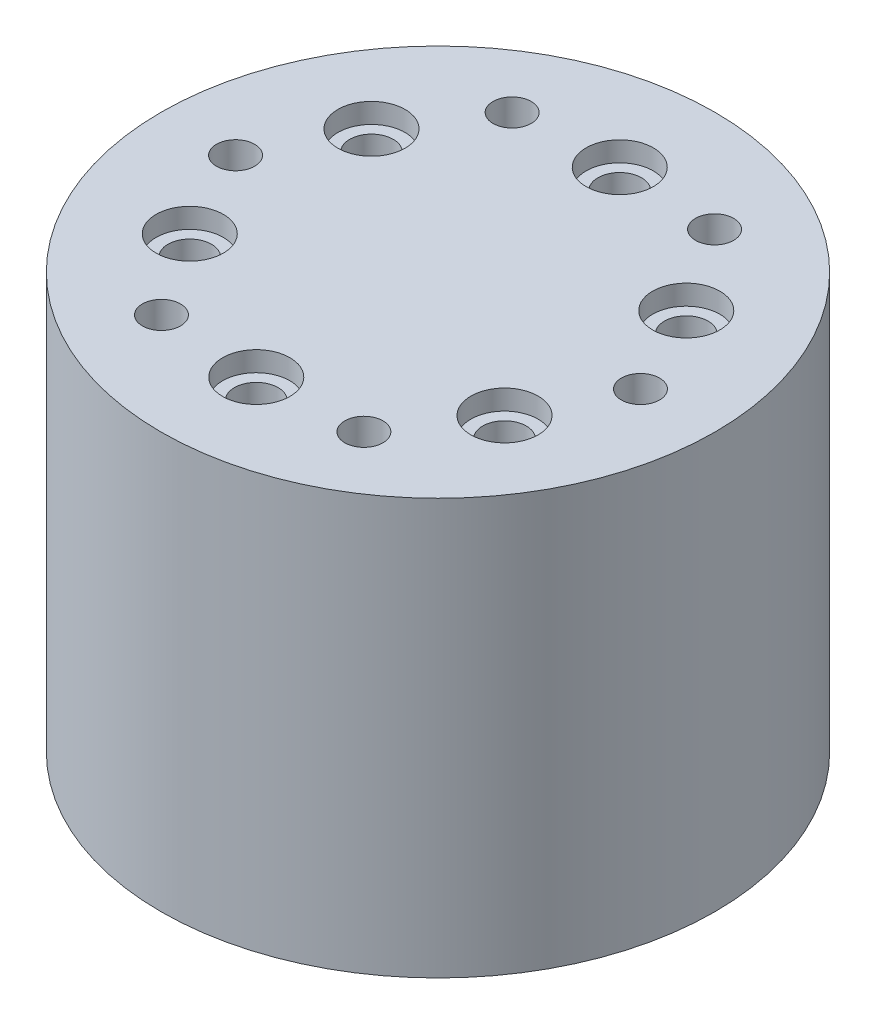
ISO-10303-21;
HEADER;
FILE_DESCRIPTION(('STEP AP214'),'2;1');
FILE_NAME('part.step','',(''),(''),'','','');
FILE_SCHEMA(('AUTOMOTIVE_DESIGN { 1 0 10303 214 1 1 1 1 }'));
ENDSEC;
DATA;
#1=APPLICATION_CONTEXT('core data for automotive mechanical design processes');
#2=APPLICATION_PROTOCOL_DEFINITION('international standard','automotive_design',2000,#1);
#3=PRODUCT_CONTEXT('',#1,'mechanical');
#4=PRODUCT('Part','Part','',(#3));
#5=PRODUCT_RELATED_PRODUCT_CATEGORY('part','',(#4));
#6=PRODUCT_DEFINITION_FORMATION('','',#4);
#7=PRODUCT_DEFINITION_CONTEXT('part definition',#1,'design');
#8=PRODUCT_DEFINITION('design','',#6,#7);
#9=PRODUCT_DEFINITION_SHAPE('','',#8);
#10=(LENGTH_UNIT() NAMED_UNIT(*) SI_UNIT(.MILLI.,.METRE.));
#11=(NAMED_UNIT(*) PLANE_ANGLE_UNIT() SI_UNIT($,.RADIAN.));
#12=(NAMED_UNIT(*) SI_UNIT($,.STERADIAN.) SOLID_ANGLE_UNIT());
#13=UNCERTAINTY_MEASURE_WITH_UNIT(LENGTH_MEASURE(1.E-05),#10,'distance_accuracy_value','');
#14=(GEOMETRIC_REPRESENTATION_CONTEXT(3) GLOBAL_UNCERTAINTY_ASSIGNED_CONTEXT((#13)) GLOBAL_UNIT_ASSIGNED_CONTEXT((#10,
#11,#12)) REPRESENTATION_CONTEXT('',''));
#15=CARTESIAN_POINT('',(0.,0.,0.));
#16=DIRECTION('',(0.,0.,1.));
#17=DIRECTION('',(1.,0.,0.));
#18=AXIS2_PLACEMENT_3D('',#15,#16,#17);
#19=CARTESIAN_POINT('',(0.,114.3,0.));
#20=DIRECTION('',(0.,-1.,0.));
#21=DIRECTION('',(0.,0.,-1.));
#22=AXIS2_PLACEMENT_3D('',#19,#20,#21);
#23=CYLINDRICAL_SURFACE('',#22,76.2);
#24=CARTESIAN_POINT('',(0.,114.3,0.));
#25=DIRECTION('',(0.,1.,0.));
#26=DIRECTION('',(0.,0.,1.));
#27=AXIS2_PLACEMENT_3D('',#24,#25,#26);
#28=CIRCLE('',#27,76.2);
#29=CARTESIAN_POINT('',(0.,114.3,76.2));
#30=VERTEX_POINT('',#29);
#31=EDGE_CURVE('E11',#30,#30,#28,.T.);
#32=ORIENTED_EDGE('',*,*,#31,.F.);
#33=EDGE_LOOP('',(#32));
#34=FACE_BOUND('',#33,.T.);
#35=CARTESIAN_POINT('',(0.,0.,0.));
#36=DIRECTION('',(0.,1.,0.));
#37=DIRECTION('',(0.,0.,1.));
#38=AXIS2_PLACEMENT_3D('',#35,#36,#37);
#39=CIRCLE('',#38,76.2);
#40=CARTESIAN_POINT('',(0.,0.,76.2));
#41=VERTEX_POINT('',#40);
#42=EDGE_CURVE('E46',#41,#41,#39,.T.);
#43=ORIENTED_EDGE('',*,*,#42,.T.);
#44=EDGE_LOOP('',(#43));
#45=FACE_BOUND('',#44,.T.);
#46=ADVANCED_FACE('F43',(#34,#45),#23,.T.);
#47=CARTESIAN_POINT('',(0.,114.3,0.));
#48=DIRECTION('',(0.,1.,0.));
#49=DIRECTION('',(0.,0.,1.));
#50=AXIS2_PLACEMENT_3D('',#47,#48,#49);
#51=PLANE('',#50);
#52=CARTESIAN_POINT('',(27.8500000000006,114.3,-48.2376149907929));
#53=DIRECTION('',(0.,1.,0.));
#54=DIRECTION('',(0.,0.,1.));
#55=AXIS2_PLACEMENT_3D('',#52,#53,#54);
#56=CIRCLE('',#55,5.24999999999999);
#57=CARTESIAN_POINT('',(27.8500000000006,114.3,-42.9876149907929));
#58=VERTEX_POINT('',#57);
#59=EDGE_CURVE('E80',#58,#58,#56,.T.);
#60=ORIENTED_EDGE('',*,*,#59,.F.);
#61=EDGE_LOOP('',(#60));
#62=FACE_BOUND('',#61,.T.);
#63=CARTESIAN_POINT('',(-27.8499999999996,114.3,-48.2376149907935));
#64=DIRECTION('',(0.,1.,0.));
#65=DIRECTION('',(0.,0.,1.));
#66=AXIS2_PLACEMENT_3D('',#63,#64,#65);
#67=CIRCLE('',#66,5.24999999999999);
#68=CARTESIAN_POINT('',(-27.8499999999996,114.3,-42.9876149907935));
#69=VERTEX_POINT('',#68);
#70=EDGE_CURVE('E79',#69,#69,#67,.T.);
#71=ORIENTED_EDGE('',*,*,#70,.F.);
#72=EDGE_LOOP('',(#71));
#73=FACE_BOUND('',#72,.T.);
#74=CARTESIAN_POINT('',(-55.7,114.3,0.));
#75=DIRECTION('',(0.,1.,0.));
#76=DIRECTION('',(0.,0.,1.));
#77=AXIS2_PLACEMENT_3D('',#74,#75,#76);
#78=CIRCLE('',#77,5.24999999999999);
#79=CARTESIAN_POINT('',(-55.7,114.3,5.24999999999999));
#80=VERTEX_POINT('',#79);
#81=EDGE_CURVE('E90',#80,#80,#78,.T.);
#82=ORIENTED_EDGE('',*,*,#81,.F.);
#83=EDGE_LOOP('',(#82));
#84=FACE_BOUND('',#83,.T.);
#85=CARTESIAN_POINT('',(-27.8500000000002,114.3,48.2376149907931));
#86=DIRECTION('',(0.,1.,0.));
#87=DIRECTION('',(0.,0.,1.));
#88=AXIS2_PLACEMENT_3D('',#85,#86,#87);
#89=CIRCLE('',#88,5.24999999999999);
#90=CARTESIAN_POINT('',(-27.8500000000002,114.3,53.4876149907931));
#91=VERTEX_POINT('',#90);
#92=EDGE_CURVE('E96',#91,#91,#89,.T.);
#93=ORIENTED_EDGE('',*,*,#92,.F.);
#94=EDGE_LOOP('',(#93));
#95=FACE_BOUND('',#94,.T.);
#96=CARTESIAN_POINT('',(27.8499999999999,114.3,48.2376149907933));
#97=DIRECTION('',(0.,1.,0.));
#98=DIRECTION('',(0.,0.,1.));
#99=AXIS2_PLACEMENT_3D('',#96,#97,#98);
#100=CIRCLE('',#99,5.24999999999999);
#101=CARTESIAN_POINT('',(27.8499999999999,114.3,53.4876149907933));
#102=VERTEX_POINT('',#101);
#103=EDGE_CURVE('E102',#102,#102,#100,.T.);
#104=ORIENTED_EDGE('',*,*,#103,.F.);
#105=EDGE_LOOP('',(#104));
#106=FACE_BOUND('',#105,.T.);
#107=CARTESIAN_POINT('',(55.7,114.3,0.));
#108=DIRECTION('',(0.,1.,0.));
#109=DIRECTION('',(0.,0.,1.));
#110=AXIS2_PLACEMENT_3D('',#107,#108,#109);
#111=CIRCLE('',#110,5.24999999999999);
#112=CARTESIAN_POINT('',(55.7,114.3,5.24999999999999));
#113=VERTEX_POINT('',#112);
#114=EDGE_CURVE('E108',#113,#113,#111,.T.);
#115=ORIENTED_EDGE('',*,*,#114,.F.);
#116=EDGE_LOOP('',(#115));
#117=FACE_BOUND('',#116,.T.);
#118=CARTESIAN_POINT('',(0.,114.3,-50.));
#119=DIRECTION('',(0.,1.,0.));
#120=DIRECTION('',(0.,0.,1.));
#121=AXIS2_PLACEMENT_3D('',#118,#119,#120);
#122=CIRCLE('',#121,9.25);
#123=CARTESIAN_POINT('',(0.,114.3,-40.75));
#124=VERTEX_POINT('',#123);
#125=EDGE_CURVE('E114',#124,#124,#122,.T.);
#126=ORIENTED_EDGE('',*,*,#125,.F.);
#127=EDGE_LOOP('',(#126));
#128=FACE_BOUND('',#127,.T.);
#129=CARTESIAN_POINT('',(43.3012701892219,114.3,-25.));
#130=DIRECTION('',(0.,1.,0.));
#131=DIRECTION('',(0.,0.,1.));
#132=AXIS2_PLACEMENT_3D('',#129,#130,#131);
#133=CIRCLE('',#132,9.24999999999999);
#134=CARTESIAN_POINT('',(43.3012701892219,114.3,-15.75));
#135=VERTEX_POINT('',#134);
#136=EDGE_CURVE('E126',#135,#135,#133,.T.);
#137=ORIENTED_EDGE('',*,*,#136,.F.);
#138=EDGE_LOOP('',(#137));
#139=FACE_BOUND('',#138,.T.);
#140=CARTESIAN_POINT('',(43.3012701892219,114.3,25.));
#141=DIRECTION('',(0.,1.,0.));
#142=DIRECTION('',(0.,0.,1.));
#143=AXIS2_PLACEMENT_3D('',#140,#141,#142);
#144=CIRCLE('',#143,9.24999999999999);
#145=CARTESIAN_POINT('',(43.3012701892219,114.3,34.25));
#146=VERTEX_POINT('',#145);
#147=EDGE_CURVE('E138',#146,#146,#144,.T.);
#148=ORIENTED_EDGE('',*,*,#147,.F.);
#149=EDGE_LOOP('',(#148));
#150=FACE_BOUND('',#149,.T.);
#151=CARTESIAN_POINT('',(0.,114.3,50.));
#152=DIRECTION('',(0.,1.,0.));
#153=DIRECTION('',(0.,0.,1.));
#154=AXIS2_PLACEMENT_3D('',#151,#152,#153);
#155=CIRCLE('',#154,9.25);
#156=CARTESIAN_POINT('',(0.,114.3,59.25));
#157=VERTEX_POINT('',#156);
#158=EDGE_CURVE('E150',#157,#157,#155,.T.);
#159=ORIENTED_EDGE('',*,*,#158,.F.);
#160=EDGE_LOOP('',(#159));
#161=FACE_BOUND('',#160,.T.);
#162=CARTESIAN_POINT('',(-43.3012701892219,114.3,25.));
#163=DIRECTION('',(0.,1.,0.));
#164=DIRECTION('',(0.,0.,1.));
#165=AXIS2_PLACEMENT_3D('',#162,#163,#164);
#166=CIRCLE('',#165,9.25);
#167=CARTESIAN_POINT('',(-43.3012701892219,114.3,34.25));
#168=VERTEX_POINT('',#167);
#169=EDGE_CURVE('E162',#168,#168,#166,.T.);
#170=ORIENTED_EDGE('',*,*,#169,.F.);
#171=EDGE_LOOP('',(#170));
#172=FACE_BOUND('',#171,.T.);
#173=CARTESIAN_POINT('',(-43.3012701892219,114.3,-25.));
#174=DIRECTION('',(0.,1.,0.));
#175=DIRECTION('',(0.,0.,1.));
#176=AXIS2_PLACEMENT_3D('',#173,#174,#175);
#177=CIRCLE('',#176,9.25);
#178=CARTESIAN_POINT('',(-43.3012701892219,114.3,-15.75));
#179=VERTEX_POINT('',#178);
#180=EDGE_CURVE('E174',#179,#179,#177,.T.);
#181=ORIENTED_EDGE('',*,*,#180,.F.);
#182=EDGE_LOOP('',(#181));
#183=FACE_BOUND('',#182,.T.);
#184=ORIENTED_EDGE('',*,*,#31,.T.);
#185=EDGE_LOOP('',(#184));
#186=FACE_BOUND('',#185,.T.);
#187=ADVANCED_FACE('F194',(#62,#73,#84,#95,#106,#117,#128,#139,#150,#161,#172,#183,#186),#51,.T.);
#188=CARTESIAN_POINT('',(0.,0.,0.));
#189=DIRECTION('',(0.,1.,0.));
#190=DIRECTION('',(0.,0.,1.));
#191=AXIS2_PLACEMENT_3D('',#188,#189,#190);
#192=PLANE('',#191);
#193=CARTESIAN_POINT('',(0.,0.,-50.));
#194=DIRECTION('',(0.,1.,0.));
#195=DIRECTION('',(0.,0.,1.));
#196=AXIS2_PLACEMENT_3D('',#193,#194,#195);
#197=CIRCLE('',#196,5.99999999999997);
#198=CARTESIAN_POINT('',(0.,0.,-44.));
#199=VERTEX_POINT('',#198);
#200=EDGE_CURVE('E123',#199,#199,#197,.T.);
#201=ORIENTED_EDGE('',*,*,#200,.T.);
#202=EDGE_LOOP('',(#201));
#203=FACE_BOUND('',#202,.T.);
#204=CARTESIAN_POINT('',(43.3012701892219,0.,-25.));
#205=DIRECTION('',(0.,1.,0.));
#206=DIRECTION('',(0.,0.,1.));
#207=AXIS2_PLACEMENT_3D('',#204,#205,#206);
#208=CIRCLE('',#207,5.99999999999997);
#209=CARTESIAN_POINT('',(43.3012701892219,0.,-19.));
#210=VERTEX_POINT('',#209);
#211=EDGE_CURVE('E135',#210,#210,#208,.T.);
#212=ORIENTED_EDGE('',*,*,#211,.T.);
#213=EDGE_LOOP('',(#212));
#214=FACE_BOUND('',#213,.T.);
#215=CARTESIAN_POINT('',(43.3012701892219,0.,25.));
#216=DIRECTION('',(0.,1.,0.));
#217=DIRECTION('',(0.,0.,1.));
#218=AXIS2_PLACEMENT_3D('',#215,#216,#217);
#219=CIRCLE('',#218,5.99999999999997);
#220=CARTESIAN_POINT('',(43.3012701892219,0.,31.));
#221=VERTEX_POINT('',#220);
#222=EDGE_CURVE('E147',#221,#221,#219,.T.);
#223=ORIENTED_EDGE('',*,*,#222,.T.);
#224=EDGE_LOOP('',(#223));
#225=FACE_BOUND('',#224,.T.);
#226=CARTESIAN_POINT('',(0.,0.,50.));
#227=DIRECTION('',(0.,1.,0.));
#228=DIRECTION('',(0.,0.,1.));
#229=AXIS2_PLACEMENT_3D('',#226,#227,#228);
#230=CIRCLE('',#229,5.99999999999997);
#231=CARTESIAN_POINT('',(0.,0.,56.));
#232=VERTEX_POINT('',#231);
#233=EDGE_CURVE('E159',#232,#232,#230,.T.);
#234=ORIENTED_EDGE('',*,*,#233,.T.);
#235=EDGE_LOOP('',(#234));
#236=FACE_BOUND('',#235,.T.);
#237=CARTESIAN_POINT('',(-43.3012701892219,0.,25.));
#238=DIRECTION('',(0.,1.,0.));
#239=DIRECTION('',(0.,0.,1.));
#240=AXIS2_PLACEMENT_3D('',#237,#238,#239);
#241=CIRCLE('',#240,5.99999999999997);
#242=CARTESIAN_POINT('',(-43.3012701892219,0.,31.));
#243=VERTEX_POINT('',#242);
#244=EDGE_CURVE('E171',#243,#243,#241,.T.);
#245=ORIENTED_EDGE('',*,*,#244,.T.);
#246=EDGE_LOOP('',(#245));
#247=FACE_BOUND('',#246,.T.);
#248=CARTESIAN_POINT('',(-43.3012701892219,0.,-25.));
#249=DIRECTION('',(0.,1.,0.));
#250=DIRECTION('',(0.,0.,1.));
#251=AXIS2_PLACEMENT_3D('',#248,#249,#250);
#252=CIRCLE('',#251,5.99999999999997);
#253=CARTESIAN_POINT('',(-43.3012701892219,0.,-19.));
#254=VERTEX_POINT('',#253);
#255=EDGE_CURVE('E183',#254,#254,#252,.T.);
#256=ORIENTED_EDGE('',*,*,#255,.T.);
#257=EDGE_LOOP('',(#256));
#258=FACE_BOUND('',#257,.T.);
#259=ORIENTED_EDGE('',*,*,#42,.F.);
#260=EDGE_LOOP('',(#259));
#261=FACE_BOUND('',#260,.T.);
#262=ADVANCED_FACE('F191',(#203,#214,#225,#236,#247,#258,#261),#192,.F.);
#263=CARTESIAN_POINT('',(-43.3012701892219,114.3,-25.));
#264=DIRECTION('',(0.,1.,0.));
#265=DIRECTION('',(0.,0.,1.));
#266=AXIS2_PLACEMENT_3D('',#263,#264,#265);
#267=CYLINDRICAL_SURFACE('',#266,5.99999999999999);
#268=ORIENTED_EDGE('',*,*,#255,.F.);
#269=EDGE_LOOP('',(#268));
#270=FACE_BOUND('',#269,.T.);
#271=CARTESIAN_POINT('',(-43.3012701892219,108.8,-25.));
#272=DIRECTION('',(0.,1.,0.));
#273=DIRECTION('',(0.,0.,1.));
#274=AXIS2_PLACEMENT_3D('',#271,#272,#273);
#275=CIRCLE('',#274,6.00000000000001);
#276=CARTESIAN_POINT('',(-43.3012701892219,108.8,-19.));
#277=VERTEX_POINT('',#276);
#278=EDGE_CURVE('E180',#277,#277,#275,.T.);
#279=ORIENTED_EDGE('',*,*,#278,.T.);
#280=EDGE_LOOP('',(#279));
#281=FACE_BOUND('',#280,.T.);
#282=ADVANCED_FACE('F193',(#270,#281),#267,.F.);
#283=CARTESIAN_POINT('',(-37.3012701892219,108.8,-25.));
#284=DIRECTION('',(0.,-1.,0.));
#285=DIRECTION('',(0.,0.,-1.));
#286=AXIS2_PLACEMENT_3D('',#283,#284,#285);
#287=PLANE('',#286);
#288=ORIENTED_EDGE('',*,*,#278,.F.);
#289=EDGE_LOOP('',(#288));
#290=FACE_BOUND('',#289,.T.);
#291=CARTESIAN_POINT('',(-43.3012701892219,108.8,-25.));
#292=DIRECTION('',(0.,1.,0.));
#293=DIRECTION('',(0.,0.,1.));
#294=AXIS2_PLACEMENT_3D('',#291,#292,#293);
#295=CIRCLE('',#294,9.25);
#296=CARTESIAN_POINT('',(-43.3012701892219,108.8,-15.75));
#297=VERTEX_POINT('',#296);
#298=EDGE_CURVE('E177',#297,#297,#295,.T.);
#299=ORIENTED_EDGE('',*,*,#298,.T.);
#300=EDGE_LOOP('',(#299));
#301=FACE_BOUND('',#300,.T.);
#302=ADVANCED_FACE('F200',(#290,#301),#287,.F.);
#303=CARTESIAN_POINT('',(-43.3012701892219,114.3,-25.));
#304=DIRECTION('',(0.,1.,0.));
#305=DIRECTION('',(0.,0.,1.));
#306=AXIS2_PLACEMENT_3D('',#303,#304,#305);
#307=CYLINDRICAL_SURFACE('',#306,9.25);
#308=ORIENTED_EDGE('',*,*,#298,.F.);
#309=EDGE_LOOP('',(#308));
#310=FACE_BOUND('',#309,.T.);
#311=ORIENTED_EDGE('',*,*,#180,.T.);
#312=EDGE_LOOP('',(#311));
#313=FACE_BOUND('',#312,.T.);
#314=ADVANCED_FACE('F385',(#310,#313),#307,.F.);
#315=CARTESIAN_POINT('',(-43.3012701892219,114.3,25.));
#316=DIRECTION('',(0.,1.,0.));
#317=DIRECTION('',(0.,0.,1.));
#318=AXIS2_PLACEMENT_3D('',#315,#316,#317);
#319=CYLINDRICAL_SURFACE('',#318,5.99999999999999);
#320=ORIENTED_EDGE('',*,*,#244,.F.);
#321=EDGE_LOOP('',(#320));
#322=FACE_BOUND('',#321,.T.);
#323=CARTESIAN_POINT('',(-43.3012701892219,108.8,25.));
#324=DIRECTION('',(0.,1.,0.));
#325=DIRECTION('',(0.,0.,1.));
#326=AXIS2_PLACEMENT_3D('',#323,#324,#325);
#327=CIRCLE('',#326,6.00000000000001);
#328=CARTESIAN_POINT('',(-43.3012701892219,108.8,31.));
#329=VERTEX_POINT('',#328);
#330=EDGE_CURVE('E168',#329,#329,#327,.T.);
#331=ORIENTED_EDGE('',*,*,#330,.T.);
#332=EDGE_LOOP('',(#331));
#333=FACE_BOUND('',#332,.T.);
#334=ADVANCED_FACE('F381',(#322,#333),#319,.F.);
#335=CARTESIAN_POINT('',(-37.3012701892219,108.8,25.));
#336=DIRECTION('',(0.,-1.,0.));
#337=DIRECTION('',(0.,0.,-1.));
#338=AXIS2_PLACEMENT_3D('',#335,#336,#337);
#339=PLANE('',#338);
#340=ORIENTED_EDGE('',*,*,#330,.F.);
#341=EDGE_LOOP('',(#340));
#342=FACE_BOUND('',#341,.T.);
#343=CARTESIAN_POINT('',(-43.3012701892219,108.8,25.));
#344=DIRECTION('',(0.,1.,0.));
#345=DIRECTION('',(0.,0.,1.));
#346=AXIS2_PLACEMENT_3D('',#343,#344,#345);
#347=CIRCLE('',#346,9.25);
#348=CARTESIAN_POINT('',(-43.3012701892219,108.8,34.25));
#349=VERTEX_POINT('',#348);
#350=EDGE_CURVE('E165',#349,#349,#347,.T.);
#351=ORIENTED_EDGE('',*,*,#350,.T.);
#352=EDGE_LOOP('',(#351));
#353=FACE_BOUND('',#352,.T.);
#354=ADVANCED_FACE('F377',(#342,#353),#339,.F.);
#355=CARTESIAN_POINT('',(-43.3012701892219,114.3,25.));
#356=DIRECTION('',(0.,1.,0.));
#357=DIRECTION('',(0.,0.,1.));
#358=AXIS2_PLACEMENT_3D('',#355,#356,#357);
#359=CYLINDRICAL_SURFACE('',#358,9.25);
#360=ORIENTED_EDGE('',*,*,#350,.F.);
#361=EDGE_LOOP('',(#360));
#362=FACE_BOUND('',#361,.T.);
#363=ORIENTED_EDGE('',*,*,#169,.T.);
#364=EDGE_LOOP('',(#363));
#365=FACE_BOUND('',#364,.T.);
#366=ADVANCED_FACE('F373',(#362,#365),#359,.F.);
#367=CARTESIAN_POINT('',(0.,114.3,50.));
#368=DIRECTION('',(0.,1.,0.));
#369=DIRECTION('',(0.,0.,1.));
#370=AXIS2_PLACEMENT_3D('',#367,#368,#369);
#371=CYLINDRICAL_SURFACE('',#370,5.99999999999999);
#372=ORIENTED_EDGE('',*,*,#233,.F.);
#373=EDGE_LOOP('',(#372));
#374=FACE_BOUND('',#373,.T.);
#375=CARTESIAN_POINT('',(0.,108.8,50.));
#376=DIRECTION('',(0.,1.,0.));
#377=DIRECTION('',(0.,0.,1.));
#378=AXIS2_PLACEMENT_3D('',#375,#376,#377);
#379=CIRCLE('',#378,6.00000000000001);
#380=CARTESIAN_POINT('',(0.,108.8,56.));
#381=VERTEX_POINT('',#380);
#382=EDGE_CURVE('E156',#381,#381,#379,.T.);
#383=ORIENTED_EDGE('',*,*,#382,.T.);
#384=EDGE_LOOP('',(#383));
#385=FACE_BOUND('',#384,.T.);
#386=ADVANCED_FACE('F369',(#374,#385),#371,.F.);
#387=CARTESIAN_POINT('',(6.00000000000002,108.8,50.));
#388=DIRECTION('',(0.,-1.,0.));
#389=DIRECTION('',(0.,0.,-1.));
#390=AXIS2_PLACEMENT_3D('',#387,#388,#389);
#391=PLANE('',#390);
#392=ORIENTED_EDGE('',*,*,#382,.F.);
#393=EDGE_LOOP('',(#392));
#394=FACE_BOUND('',#393,.T.);
#395=CARTESIAN_POINT('',(0.,108.8,50.));
#396=DIRECTION('',(0.,1.,0.));
#397=DIRECTION('',(0.,0.,1.));
#398=AXIS2_PLACEMENT_3D('',#395,#396,#397);
#399=CIRCLE('',#398,9.25);
#400=CARTESIAN_POINT('',(0.,108.8,59.25));
#401=VERTEX_POINT('',#400);
#402=EDGE_CURVE('E153',#401,#401,#399,.T.);
#403=ORIENTED_EDGE('',*,*,#402,.T.);
#404=EDGE_LOOP('',(#403));
#405=FACE_BOUND('',#404,.T.);
#406=ADVANCED_FACE('F365',(#394,#405),#391,.F.);
#407=CARTESIAN_POINT('',(0.,114.3,50.));
#408=DIRECTION('',(0.,1.,0.));
#409=DIRECTION('',(0.,0.,1.));
#410=AXIS2_PLACEMENT_3D('',#407,#408,#409);
#411=CYLINDRICAL_SURFACE('',#410,9.25);
#412=ORIENTED_EDGE('',*,*,#402,.F.);
#413=EDGE_LOOP('',(#412));
#414=FACE_BOUND('',#413,.T.);
#415=ORIENTED_EDGE('',*,*,#158,.T.);
#416=EDGE_LOOP('',(#415));
#417=FACE_BOUND('',#416,.T.);
#418=ADVANCED_FACE('F361',(#414,#417),#411,.F.);
#419=CARTESIAN_POINT('',(43.3012701892219,114.3,25.));
#420=DIRECTION('',(0.,1.,0.));
#421=DIRECTION('',(0.,0.,1.));
#422=AXIS2_PLACEMENT_3D('',#419,#420,#421);
#423=CYLINDRICAL_SURFACE('',#422,5.99999999999999);
#424=ORIENTED_EDGE('',*,*,#222,.F.);
#425=EDGE_LOOP('',(#424));
#426=FACE_BOUND('',#425,.T.);
#427=CARTESIAN_POINT('',(43.3012701892219,108.8,25.));
#428=DIRECTION('',(0.,1.,0.));
#429=DIRECTION('',(0.,0.,1.));
#430=AXIS2_PLACEMENT_3D('',#427,#428,#429);
#431=CIRCLE('',#430,6.00000000000001);
#432=CARTESIAN_POINT('',(43.3012701892219,108.8,31.));
#433=VERTEX_POINT('',#432);
#434=EDGE_CURVE('E144',#433,#433,#431,.T.);
#435=ORIENTED_EDGE('',*,*,#434,.T.);
#436=EDGE_LOOP('',(#435));
#437=FACE_BOUND('',#436,.T.);
#438=ADVANCED_FACE('F357',(#426,#437),#423,.F.);
#439=CARTESIAN_POINT('',(49.301270189222,108.8,25.));
#440=DIRECTION('',(0.,-1.,0.));
#441=DIRECTION('',(0.,0.,-1.));
#442=AXIS2_PLACEMENT_3D('',#439,#440,#441);
#443=PLANE('',#442);
#444=ORIENTED_EDGE('',*,*,#434,.F.);
#445=EDGE_LOOP('',(#444));
#446=FACE_BOUND('',#445,.T.);
#447=CARTESIAN_POINT('',(43.3012701892219,108.8,25.));
#448=DIRECTION('',(0.,1.,0.));
#449=DIRECTION('',(0.,0.,1.));
#450=AXIS2_PLACEMENT_3D('',#447,#448,#449);
#451=CIRCLE('',#450,9.24999999999999);
#452=CARTESIAN_POINT('',(43.3012701892219,108.8,34.25));
#453=VERTEX_POINT('',#452);
#454=EDGE_CURVE('E141',#453,#453,#451,.T.);
#455=ORIENTED_EDGE('',*,*,#454,.T.);
#456=EDGE_LOOP('',(#455));
#457=FACE_BOUND('',#456,.T.);
#458=ADVANCED_FACE('F353',(#446,#457),#443,.F.);
#459=CARTESIAN_POINT('',(43.3012701892219,114.3,25.));
#460=DIRECTION('',(0.,1.,0.));
#461=DIRECTION('',(0.,0.,1.));
#462=AXIS2_PLACEMENT_3D('',#459,#460,#461);
#463=CYLINDRICAL_SURFACE('',#462,9.24999999999999);
#464=ORIENTED_EDGE('',*,*,#454,.F.);
#465=EDGE_LOOP('',(#464));
#466=FACE_BOUND('',#465,.T.);
#467=ORIENTED_EDGE('',*,*,#147,.T.);
#468=EDGE_LOOP('',(#467));
#469=FACE_BOUND('',#468,.T.);
#470=ADVANCED_FACE('F349',(#466,#469),#463,.F.);
#471=CARTESIAN_POINT('',(43.3012701892219,114.3,-25.));
#472=DIRECTION('',(0.,1.,0.));
#473=DIRECTION('',(0.,0.,1.));
#474=AXIS2_PLACEMENT_3D('',#471,#472,#473);
#475=CYLINDRICAL_SURFACE('',#474,5.99999999999999);
#476=ORIENTED_EDGE('',*,*,#211,.F.);
#477=EDGE_LOOP('',(#476));
#478=FACE_BOUND('',#477,.T.);
#479=CARTESIAN_POINT('',(43.3012701892219,108.8,-25.));
#480=DIRECTION('',(0.,1.,0.));
#481=DIRECTION('',(0.,0.,1.));
#482=AXIS2_PLACEMENT_3D('',#479,#480,#481);
#483=CIRCLE('',#482,6.00000000000001);
#484=CARTESIAN_POINT('',(43.3012701892219,108.8,-19.));
#485=VERTEX_POINT('',#484);
#486=EDGE_CURVE('E132',#485,#485,#483,.T.);
#487=ORIENTED_EDGE('',*,*,#486,.T.);
#488=EDGE_LOOP('',(#487));
#489=FACE_BOUND('',#488,.T.);
#490=ADVANCED_FACE('F345',(#478,#489),#475,.F.);
#491=CARTESIAN_POINT('',(49.3012701892219,108.8,-25.));
#492=DIRECTION('',(0.,-1.,0.));
#493=DIRECTION('',(0.,0.,-1.));
#494=AXIS2_PLACEMENT_3D('',#491,#492,#493);
#495=PLANE('',#494);
#496=ORIENTED_EDGE('',*,*,#486,.F.);
#497=EDGE_LOOP('',(#496));
#498=FACE_BOUND('',#497,.T.);
#499=CARTESIAN_POINT('',(43.3012701892219,108.8,-25.));
#500=DIRECTION('',(0.,1.,0.));
#501=DIRECTION('',(0.,0.,1.));
#502=AXIS2_PLACEMENT_3D('',#499,#500,#501);
#503=CIRCLE('',#502,9.24999999999999);
#504=CARTESIAN_POINT('',(43.3012701892219,108.8,-15.75));
#505=VERTEX_POINT('',#504);
#506=EDGE_CURVE('E129',#505,#505,#503,.T.);
#507=ORIENTED_EDGE('',*,*,#506,.T.);
#508=EDGE_LOOP('',(#507));
#509=FACE_BOUND('',#508,.T.);
#510=ADVANCED_FACE('F341',(#498,#509),#495,.F.);
#511=CARTESIAN_POINT('',(43.3012701892219,114.3,-25.));
#512=DIRECTION('',(0.,1.,0.));
#513=DIRECTION('',(0.,0.,1.));
#514=AXIS2_PLACEMENT_3D('',#511,#512,#513);
#515=CYLINDRICAL_SURFACE('',#514,9.24999999999999);
#516=ORIENTED_EDGE('',*,*,#506,.F.);
#517=EDGE_LOOP('',(#516));
#518=FACE_BOUND('',#517,.T.);
#519=ORIENTED_EDGE('',*,*,#136,.T.);
#520=EDGE_LOOP('',(#519));
#521=FACE_BOUND('',#520,.T.);
#522=ADVANCED_FACE('F337',(#518,#521),#515,.F.);
#523=CARTESIAN_POINT('',(0.,114.3,-50.));
#524=DIRECTION('',(0.,1.,0.));
#525=DIRECTION('',(0.,0.,1.));
#526=AXIS2_PLACEMENT_3D('',#523,#524,#525);
#527=CYLINDRICAL_SURFACE('',#526,5.99999999999999);
#528=ORIENTED_EDGE('',*,*,#200,.F.);
#529=EDGE_LOOP('',(#528));
#530=FACE_BOUND('',#529,.T.);
#531=CARTESIAN_POINT('',(0.,108.8,-50.));
#532=DIRECTION('',(0.,1.,0.));
#533=DIRECTION('',(0.,0.,1.));
#534=AXIS2_PLACEMENT_3D('',#531,#532,#533);
#535=CIRCLE('',#534,6.00000000000001);
#536=CARTESIAN_POINT('',(0.,108.8,-44.));
#537=VERTEX_POINT('',#536);
#538=EDGE_CURVE('E120',#537,#537,#535,.T.);
#539=ORIENTED_EDGE('',*,*,#538,.T.);
#540=EDGE_LOOP('',(#539));
#541=FACE_BOUND('',#540,.T.);
#542=ADVANCED_FACE('F333',(#530,#541),#527,.F.);
#543=CARTESIAN_POINT('',(6.00000000000001,108.8,-50.));
#544=DIRECTION('',(0.,-1.,0.));
#545=DIRECTION('',(0.,0.,-1.));
#546=AXIS2_PLACEMENT_3D('',#543,#544,#545);
#547=PLANE('',#546);
#548=ORIENTED_EDGE('',*,*,#538,.F.);
#549=EDGE_LOOP('',(#548));
#550=FACE_BOUND('',#549,.T.);
#551=CARTESIAN_POINT('',(0.,108.8,-50.));
#552=DIRECTION('',(0.,1.,0.));
#553=DIRECTION('',(0.,0.,1.));
#554=AXIS2_PLACEMENT_3D('',#551,#552,#553);
#555=CIRCLE('',#554,9.25);
#556=CARTESIAN_POINT('',(0.,108.8,-40.75));
#557=VERTEX_POINT('',#556);
#558=EDGE_CURVE('E117',#557,#557,#555,.T.);
#559=ORIENTED_EDGE('',*,*,#558,.T.);
#560=EDGE_LOOP('',(#559));
#561=FACE_BOUND('',#560,.T.);
#562=ADVANCED_FACE('F329',(#550,#561),#547,.F.);
#563=CARTESIAN_POINT('',(0.,114.3,-50.));
#564=DIRECTION('',(0.,1.,0.));
#565=DIRECTION('',(0.,0.,1.));
#566=AXIS2_PLACEMENT_3D('',#563,#564,#565);
#567=CYLINDRICAL_SURFACE('',#566,9.25);
#568=ORIENTED_EDGE('',*,*,#558,.F.);
#569=EDGE_LOOP('',(#568));
#570=FACE_BOUND('',#569,.T.);
#571=ORIENTED_EDGE('',*,*,#125,.T.);
#572=EDGE_LOOP('',(#571));
#573=FACE_BOUND('',#572,.T.);
#574=ADVANCED_FACE('F326',(#570,#573),#567,.F.);
#575=CARTESIAN_POINT('',(55.7,89.3,0.));
#576=DIRECTION('',(0.,1.,0.));
#577=DIRECTION('',(0.,0.,1.));
#578=AXIS2_PLACEMENT_3D('',#575,#576,#577);
#579=CONICAL_SURFACE('',#578,5.24999999999998,1.02974425867665);
#580=CARTESIAN_POINT('',(55.7,86.1454817501053,0.));
#581=VERTEX_POINT('',#580);
#582=VERTEX_LOOP('',#581);
#583=FACE_BOUND('',#582,.T.);
#584=CARTESIAN_POINT('',(55.7,89.3,0.));
#585=DIRECTION('',(0.,1.,0.));
#586=DIRECTION('',(0.,0.,1.));
#587=AXIS2_PLACEMENT_3D('',#584,#585,#586);
#588=CIRCLE('',#587,5.24999999999998);
#589=CARTESIAN_POINT('',(55.7,89.3,5.24999999999998));
#590=VERTEX_POINT('',#589);
#591=EDGE_CURVE('E111',#590,#590,#588,.T.);
#592=ORIENTED_EDGE('',*,*,#591,.T.);
#593=EDGE_LOOP('',(#592));
#594=FACE_BOUND('',#593,.T.);
#595=ADVANCED_FACE('F322',(#583,#594),#579,.F.);
#596=CARTESIAN_POINT('',(55.7,114.3,0.));
#597=DIRECTION('',(0.,1.,0.));
#598=DIRECTION('',(0.,0.,1.));
#599=AXIS2_PLACEMENT_3D('',#596,#597,#598);
#600=CYLINDRICAL_SURFACE('',#599,5.24999999999999);
#601=ORIENTED_EDGE('',*,*,#591,.F.);
#602=EDGE_LOOP('',(#601));
#603=FACE_BOUND('',#602,.T.);
#604=ORIENTED_EDGE('',*,*,#114,.T.);
#605=EDGE_LOOP('',(#604));
#606=FACE_BOUND('',#605,.T.);
#607=ADVANCED_FACE('F223',(#603,#606),#600,.F.);
#608=CARTESIAN_POINT('',(27.8499999999999,89.3,48.2376149907933));
#609=DIRECTION('',(0.,1.,0.));
#610=DIRECTION('',(0.,0.,1.));
#611=AXIS2_PLACEMENT_3D('',#608,#609,#610);
#612=CONICAL_SURFACE('',#611,5.24999999999999,1.02974425867665);
#613=CARTESIAN_POINT('',(27.8499999999999,86.1454817501053,48.2376149907933));
#614=VERTEX_POINT('',#613);
#615=VERTEX_LOOP('',#614);
#616=FACE_BOUND('',#615,.T.);
#617=CARTESIAN_POINT('',(27.8499999999999,89.3,48.2376149907933));
#618=DIRECTION('',(0.,1.,0.));
#619=DIRECTION('',(0.,0.,1.));
#620=AXIS2_PLACEMENT_3D('',#617,#618,#619);
#621=CIRCLE('',#620,5.24999999999999);
#622=CARTESIAN_POINT('',(27.8499999999999,89.3,53.4876149907933));
#623=VERTEX_POINT('',#622);
#624=EDGE_CURVE('E105',#623,#623,#621,.T.);
#625=ORIENTED_EDGE('',*,*,#624,.T.);
#626=EDGE_LOOP('',(#625));
#627=FACE_BOUND('',#626,.T.);
#628=ADVANCED_FACE('F228',(#616,#627),#612,.F.);
#629=CARTESIAN_POINT('',(27.8499999999999,114.3,48.2376149907933));
#630=DIRECTION('',(0.,1.,0.));
#631=DIRECTION('',(0.,0.,1.));
#632=AXIS2_PLACEMENT_3D('',#629,#630,#631);
#633=CYLINDRICAL_SURFACE('',#632,5.24999999999999);
#634=ORIENTED_EDGE('',*,*,#624,.F.);
#635=EDGE_LOOP('',(#634));
#636=FACE_BOUND('',#635,.T.);
#637=ORIENTED_EDGE('',*,*,#103,.T.);
#638=EDGE_LOOP('',(#637));
#639=FACE_BOUND('',#638,.T.);
#640=ADVANCED_FACE('F233',(#636,#639),#633,.F.);
#641=CARTESIAN_POINT('',(-27.8500000000002,89.3,48.2376149907931));
#642=DIRECTION('',(0.,1.,0.));
#643=DIRECTION('',(0.,0.,1.));
#644=AXIS2_PLACEMENT_3D('',#641,#642,#643);
#645=CONICAL_SURFACE('',#644,5.24999999999999,1.02974425867665);
#646=CARTESIAN_POINT('',(-27.8500000000002,86.1454817501053,48.2376149907931));
#647=VERTEX_POINT('',#646);
#648=VERTEX_LOOP('',#647);
#649=FACE_BOUND('',#648,.T.);
#650=CARTESIAN_POINT('',(-27.8500000000002,89.3,48.2376149907931));
#651=DIRECTION('',(0.,1.,0.));
#652=DIRECTION('',(0.,0.,1.));
#653=AXIS2_PLACEMENT_3D('',#650,#651,#652);
#654=CIRCLE('',#653,5.24999999999999);
#655=CARTESIAN_POINT('',(-27.8500000000002,89.3,53.4876149907931));
#656=VERTEX_POINT('',#655);
#657=EDGE_CURVE('E99',#656,#656,#654,.T.);
#658=ORIENTED_EDGE('',*,*,#657,.T.);
#659=EDGE_LOOP('',(#658));
#660=FACE_BOUND('',#659,.T.);
#661=ADVANCED_FACE('F242',(#649,#660),#645,.F.);
#662=CARTESIAN_POINT('',(-27.8500000000002,114.3,48.2376149907931));
#663=DIRECTION('',(0.,1.,0.));
#664=DIRECTION('',(0.,0.,1.));
#665=AXIS2_PLACEMENT_3D('',#662,#663,#664);
#666=CYLINDRICAL_SURFACE('',#665,5.24999999999999);
#667=ORIENTED_EDGE('',*,*,#657,.F.);
#668=EDGE_LOOP('',(#667));
#669=FACE_BOUND('',#668,.T.);
#670=ORIENTED_EDGE('',*,*,#92,.T.);
#671=EDGE_LOOP('',(#670));
#672=FACE_BOUND('',#671,.T.);
#673=ADVANCED_FACE('F252',(#669,#672),#666,.F.);
#674=CARTESIAN_POINT('',(-55.7,89.3,0.));
#675=DIRECTION('',(0.,1.,0.));
#676=DIRECTION('',(0.,0.,1.));
#677=AXIS2_PLACEMENT_3D('',#674,#675,#676);
#678=CONICAL_SURFACE('',#677,5.24999999999998,1.02974425867665);
#679=CARTESIAN_POINT('',(-55.7,86.1454817501053,0.));
#680=VERTEX_POINT('',#679);
#681=VERTEX_LOOP('',#680);
#682=FACE_BOUND('',#681,.T.);
#683=CARTESIAN_POINT('',(-55.7,89.3,0.));
#684=DIRECTION('',(0.,1.,0.));
#685=DIRECTION('',(0.,0.,1.));
#686=AXIS2_PLACEMENT_3D('',#683,#684,#685);
#687=CIRCLE('',#686,5.24999999999998);
#688=CARTESIAN_POINT('',(-55.7,89.3,5.24999999999998));
#689=VERTEX_POINT('',#688);
#690=EDGE_CURVE('E93',#689,#689,#687,.T.);
#691=ORIENTED_EDGE('',*,*,#690,.T.);
#692=EDGE_LOOP('',(#691));
#693=FACE_BOUND('',#692,.T.);
#694=ADVANCED_FACE('F262',(#682,#693),#678,.F.);
#695=CARTESIAN_POINT('',(-55.7,114.3,0.));
#696=DIRECTION('',(0.,1.,0.));
#697=DIRECTION('',(0.,0.,1.));
#698=AXIS2_PLACEMENT_3D('',#695,#696,#697);
#699=CYLINDRICAL_SURFACE('',#698,5.24999999999999);
#700=ORIENTED_EDGE('',*,*,#690,.F.);
#701=EDGE_LOOP('',(#700));
#702=FACE_BOUND('',#701,.T.);
#703=ORIENTED_EDGE('',*,*,#81,.T.);
#704=EDGE_LOOP('',(#703));
#705=FACE_BOUND('',#704,.T.);
#706=ADVANCED_FACE('F272',(#702,#705),#699,.F.);
#707=CARTESIAN_POINT('',(-27.8499999999996,89.3,-48.2376149907935));
#708=DIRECTION('',(0.,1.,0.));
#709=DIRECTION('',(0.,0.,1.));
#710=AXIS2_PLACEMENT_3D('',#707,#708,#709);
#711=CONICAL_SURFACE('',#710,5.24999999999999,1.02974425867665);
#712=CARTESIAN_POINT('',(-27.8499999999996,86.1454817501053,-48.2376149907935));
#713=VERTEX_POINT('',#712);
#714=VERTEX_LOOP('',#713);
#715=FACE_BOUND('',#714,.T.);
#716=CARTESIAN_POINT('',(-27.8499999999996,89.3,-48.2376149907935));
#717=DIRECTION('',(0.,1.,0.));
#718=DIRECTION('',(0.,0.,1.));
#719=AXIS2_PLACEMENT_3D('',#716,#717,#718);
#720=CIRCLE('',#719,5.24999999999999);
#721=CARTESIAN_POINT('',(-27.8499999999996,89.3,-42.9876149907935));
#722=VERTEX_POINT('',#721);
#723=EDGE_CURVE('E83',#722,#722,#720,.T.);
#724=ORIENTED_EDGE('',*,*,#723,.T.);
#725=EDGE_LOOP('',(#724));
#726=FACE_BOUND('',#725,.T.);
#727=ADVANCED_FACE('F282',(#715,#726),#711,.F.);
#728=CARTESIAN_POINT('',(-27.8499999999996,114.3,-48.2376149907935));
#729=DIRECTION('',(0.,1.,0.));
#730=DIRECTION('',(0.,0.,1.));
#731=AXIS2_PLACEMENT_3D('',#728,#729,#730);
#732=CYLINDRICAL_SURFACE('',#731,5.24999999999999);
#733=ORIENTED_EDGE('',*,*,#723,.F.);
#734=EDGE_LOOP('',(#733));
#735=FACE_BOUND('',#734,.T.);
#736=ORIENTED_EDGE('',*,*,#70,.T.);
#737=EDGE_LOOP('',(#736));
#738=FACE_BOUND('',#737,.T.);
#739=ADVANCED_FACE('F73',(#735,#738),#732,.F.);
#740=CARTESIAN_POINT('',(27.8500000000006,89.3,-48.2376149907929));
#741=DIRECTION('',(0.,1.,0.));
#742=DIRECTION('',(0.,0.,1.));
#743=AXIS2_PLACEMENT_3D('',#740,#741,#742);
#744=CONICAL_SURFACE('',#743,5.24999999999999,1.02974425867665);
#745=CARTESIAN_POINT('',(27.8500000000006,86.1454817501053,-48.2376149907929));
#746=VERTEX_POINT('',#745);
#747=VERTEX_LOOP('',#746);
#748=FACE_BOUND('',#747,.T.);
#749=CARTESIAN_POINT('',(27.8500000000006,89.3,-48.2376149907929));
#750=DIRECTION('',(0.,1.,0.));
#751=DIRECTION('',(0.,0.,1.));
#752=AXIS2_PLACEMENT_3D('',#749,#750,#751);
#753=CIRCLE('',#752,5.24999999999999);
#754=CARTESIAN_POINT('',(27.8500000000006,89.3,-42.9876149907929));
#755=VERTEX_POINT('',#754);
#756=EDGE_CURVE('E77',#755,#755,#753,.T.);
#757=ORIENTED_EDGE('',*,*,#756,.T.);
#758=EDGE_LOOP('',(#757));
#759=FACE_BOUND('',#758,.T.);
#760=ADVANCED_FACE('F69',(#748,#759),#744,.F.);
#761=CARTESIAN_POINT('',(27.8500000000006,114.3,-48.2376149907929));
#762=DIRECTION('',(0.,1.,0.));
#763=DIRECTION('',(0.,0.,1.));
#764=AXIS2_PLACEMENT_3D('',#761,#762,#763);
#765=CYLINDRICAL_SURFACE('',#764,5.24999999999999);
#766=ORIENTED_EDGE('',*,*,#756,.F.);
#767=EDGE_LOOP('',(#766));
#768=FACE_BOUND('',#767,.T.);
#769=ORIENTED_EDGE('',*,*,#59,.T.);
#770=EDGE_LOOP('',(#769));
#771=FACE_BOUND('',#770,.T.);
#772=ADVANCED_FACE('F72',(#768,#771),#765,.F.);
#773=CLOSED_SHELL('',(#46,#187,#262,#282,#302,#314,#334,#354,#366,#386,#406,#418,#438,#458,#470,
#490,#510,#522,#542,#562,#574,#595,#607,#628,#640,#661,#673,#694,#706,#727,#739,#760,#772));
#774=MANIFOLD_SOLID_BREP('B2',#773);
#775=ADVANCED_BREP_SHAPE_REPRESENTATION('',(#18,#774),#14);
#776=SHAPE_DEFINITION_REPRESENTATION(#9,#775);
ENDSEC;
END-ISO-10303-21;
